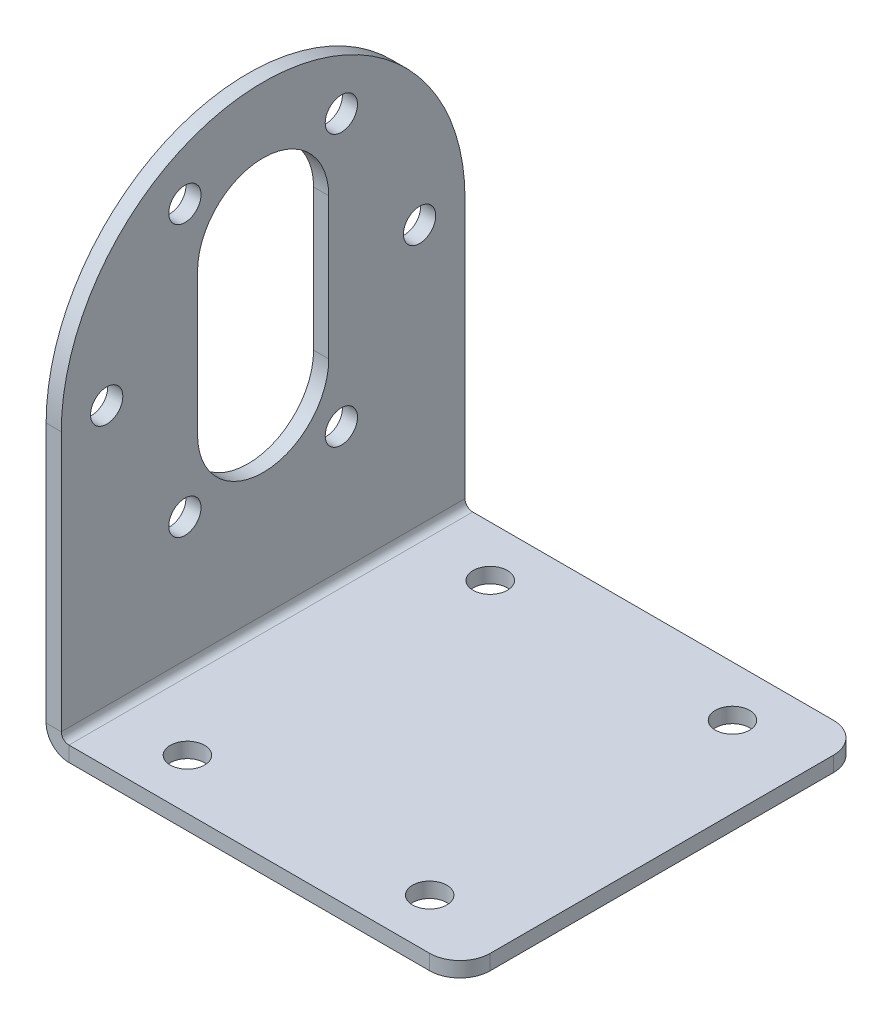
ISO-10303-21;
HEADER;
FILE_DESCRIPTION(('STEP AP214'),'2;1');
FILE_NAME('part.step','',(''),(''),'','','');
FILE_SCHEMA(('AUTOMOTIVE_DESIGN { 1 0 10303 214 1 1 1 1 }'));
ENDSEC;
DATA;
#1=APPLICATION_CONTEXT('core data for automotive mechanical design processes');
#2=APPLICATION_PROTOCOL_DEFINITION('international standard','automotive_design',2000,#1);
#3=PRODUCT_CONTEXT('',#1,'mechanical');
#4=PRODUCT('Part','Part','',(#3));
#5=PRODUCT_RELATED_PRODUCT_CATEGORY('part','',(#4));
#6=PRODUCT_DEFINITION_FORMATION('','',#4);
#7=PRODUCT_DEFINITION_CONTEXT('part definition',#1,'design');
#8=PRODUCT_DEFINITION('design','',#6,#7);
#9=PRODUCT_DEFINITION_SHAPE('','',#8);
#10=(LENGTH_UNIT() NAMED_UNIT(*) SI_UNIT(.MILLI.,.METRE.));
#11=(NAMED_UNIT(*) PLANE_ANGLE_UNIT() SI_UNIT($,.RADIAN.));
#12=(NAMED_UNIT(*) SI_UNIT($,.STERADIAN.) SOLID_ANGLE_UNIT());
#13=UNCERTAINTY_MEASURE_WITH_UNIT(LENGTH_MEASURE(1.E-05),#10,'distance_accuracy_value','');
#14=(GEOMETRIC_REPRESENTATION_CONTEXT(3) GLOBAL_UNCERTAINTY_ASSIGNED_CONTEXT((#13)) GLOBAL_UNIT_ASSIGNED_CONTEXT((#10,
#11,#12)) REPRESENTATION_CONTEXT('',''));
#15=CARTESIAN_POINT('',(0.,0.,0.));
#16=DIRECTION('',(0.,0.,1.));
#17=DIRECTION('',(1.,0.,0.));
#18=AXIS2_PLACEMENT_3D('',#15,#16,#17);
#19=CARTESIAN_POINT('',(0.,0.,0.));
#20=DIRECTION('',(1.,0.,0.));
#21=DIRECTION('',(0.,0.,-1.));
#22=AXIS2_PLACEMENT_3D('',#19,#20,#21);
#23=PLANE('',#22);
#24=DIRECTION('',(0.,-1.,0.));
#25=VECTOR('',#24,1.);
#26=CARTESIAN_POINT('',(0.,7.,-6.5));
#27=LINE('',#26,#25);
#28=CARTESIAN_POINT('',(0.,7.,-6.5));
#29=VERTEX_POINT('',#28);
#30=CARTESIAN_POINT('',(0.,-7.,-6.5));
#31=VERTEX_POINT('',#30);
#32=EDGE_CURVE('E157',#29,#31,#27,.T.);
#33=ORIENTED_EDGE('',*,*,#32,.F.);
#34=CARTESIAN_POINT('',(0.,7.,0.));
#35=DIRECTION('',(-1.,0.,0.));
#36=DIRECTION('',(0.,0.,1.));
#37=AXIS2_PLACEMENT_3D('',#34,#35,#36);
#38=CIRCLE('',#37,6.5);
#39=CARTESIAN_POINT('',(0.,7.,6.5));
#40=VERTEX_POINT('',#39);
#41=EDGE_CURVE('E162',#40,#29,#38,.T.);
#42=ORIENTED_EDGE('',*,*,#41,.F.);
#43=DIRECTION('',(0.,1.,0.));
#44=VECTOR('',#43,1.);
#45=CARTESIAN_POINT('',(0.,7.,6.5));
#46=LINE('',#45,#44);
#47=CARTESIAN_POINT('',(0.,-7.,6.5));
#48=VERTEX_POINT('',#47);
#49=EDGE_CURVE('E166',#48,#40,#46,.T.);
#50=ORIENTED_EDGE('',*,*,#49,.F.);
#51=CARTESIAN_POINT('',(0.,-7.,0.));
#52=DIRECTION('',(-1.,0.,0.));
#53=DIRECTION('',(0.,0.,1.));
#54=AXIS2_PLACEMENT_3D('',#51,#52,#53);
#55=CIRCLE('',#54,6.5);
#56=EDGE_CURVE('E146',#31,#48,#55,.T.);
#57=ORIENTED_EDGE('',*,*,#56,.F.);
#58=EDGE_LOOP('',(#33,#42,#50,#57));
#59=FACE_BOUND('',#58,.T.);
#60=CARTESIAN_POINT('',(0.,-13.4233937586589,7.74999999999988));
#61=DIRECTION('',(-1.,0.,0.));
#62=DIRECTION('',(0.,0.,1.));
#63=AXIS2_PLACEMENT_3D('',#60,#61,#62);
#64=CIRCLE('',#63,1.6);
#65=CARTESIAN_POINT('',(0.,-13.4233937586589,9.34999999999988));
#66=VERTEX_POINT('',#65);
#67=EDGE_CURVE('E181',#66,#66,#64,.T.);
#68=ORIENTED_EDGE('',*,*,#67,.F.);
#69=EDGE_LOOP('',(#68));
#70=FACE_BOUND('',#69,.T.);
#71=CARTESIAN_POINT('',(0.,13.4233937586588,7.75000000000006));
#72=DIRECTION('',(-1.,0.,0.));
#73=DIRECTION('',(0.,0.,1.));
#74=AXIS2_PLACEMENT_3D('',#71,#72,#73);
#75=CIRCLE('',#74,1.6);
#76=CARTESIAN_POINT('',(0.,13.4233937586588,9.35000000000006));
#77=VERTEX_POINT('',#76);
#78=EDGE_CURVE('E193',#77,#77,#75,.T.);
#79=ORIENTED_EDGE('',*,*,#78,.F.);
#80=EDGE_LOOP('',(#79));
#81=FACE_BOUND('',#80,.T.);
#82=CARTESIAN_POINT('',(0.,13.4233937586588,-7.74999999999997));
#83=DIRECTION('',(-1.,0.,0.));
#84=DIRECTION('',(0.,0.,1.));
#85=AXIS2_PLACEMENT_3D('',#82,#83,#84);
#86=CIRCLE('',#85,1.6);
#87=CARTESIAN_POINT('',(0.,13.4233937586588,-6.14999999999997));
#88=VERTEX_POINT('',#87);
#89=EDGE_CURVE('E199',#88,#88,#86,.T.);
#90=ORIENTED_EDGE('',*,*,#89,.F.);
#91=EDGE_LOOP('',(#90));
#92=FACE_BOUND('',#91,.T.);
#93=CARTESIAN_POINT('',(0.,0.,-15.5));
#94=DIRECTION('',(-1.,0.,0.));
#95=DIRECTION('',(0.,0.,1.));
#96=AXIS2_PLACEMENT_3D('',#93,#94,#95);
#97=CIRCLE('',#96,1.6);
#98=CARTESIAN_POINT('',(0.,0.,-13.9));
#99=VERTEX_POINT('',#98);
#100=EDGE_CURVE('E203',#99,#99,#97,.T.);
#101=ORIENTED_EDGE('',*,*,#100,.F.);
#102=EDGE_LOOP('',(#101));
#103=FACE_BOUND('',#102,.T.);
#104=DIRECTION('',(0.,1.,0.));
#105=VECTOR('',#104,1.);
#106=CARTESIAN_POINT('',(0.,0.,-20.));
#107=LINE('',#106,#105);
#108=CARTESIAN_POINT('',(0.,-25.738,-20.));
#109=VERTEX_POINT('',#108);
#110=CARTESIAN_POINT('',(0.,0.,-20.));
#111=VERTEX_POINT('',#110);
#112=EDGE_CURVE('E224',#109,#111,#107,.T.);
#113=ORIENTED_EDGE('',*,*,#112,.F.);
#114=DIRECTION('',(0.,0.,-1.));
#115=VECTOR('',#114,1.);
#116=CARTESIAN_POINT('',(0.,-25.738,0.));
#117=LINE('',#116,#115);
#118=CARTESIAN_POINT('',(0.,-25.738,20.));
#119=VERTEX_POINT('',#118);
#120=EDGE_CURVE('E230',#109,#119,#117,.F.);
#121=ORIENTED_EDGE('',*,*,#120,.T.);
#122=DIRECTION('',(0.,-1.,0.));
#123=VECTOR('',#122,1.);
#124=CARTESIAN_POINT('',(0.,0.,20.));
#125=LINE('',#124,#123);
#126=CARTESIAN_POINT('',(0.,0.,20.));
#127=VERTEX_POINT('',#126);
#128=EDGE_CURVE('E218',#127,#119,#125,.T.);
#129=ORIENTED_EDGE('',*,*,#128,.F.);
#130=CARTESIAN_POINT('',(0.,0.,0.));
#131=DIRECTION('',(1.,0.,0.));
#132=DIRECTION('',(0.,0.,-1.));
#133=AXIS2_PLACEMENT_3D('',#130,#131,#132);
#134=CIRCLE('',#133,20.);
#135=EDGE_CURVE('E221',#111,#127,#134,.T.);
#136=ORIENTED_EDGE('',*,*,#135,.F.);
#137=EDGE_LOOP('',(#113,#121,#129,#136));
#138=FACE_BOUND('',#137,.T.);
#139=CARTESIAN_POINT('',(0.,0.,15.5));
#140=DIRECTION('',(-1.,0.,0.));
#141=DIRECTION('',(0.,0.,1.));
#142=AXIS2_PLACEMENT_3D('',#139,#140,#141);
#143=CIRCLE('',#142,1.6);
#144=CARTESIAN_POINT('',(0.,0.,17.1));
#145=VERTEX_POINT('',#144);
#146=EDGE_CURVE('E187',#145,#145,#143,.T.);
#147=ORIENTED_EDGE('',*,*,#146,.F.);
#148=EDGE_LOOP('',(#147));
#149=FACE_BOUND('',#148,.T.);
#150=CARTESIAN_POINT('',(0.,-13.4233937586587,-7.75000000000016));
#151=DIRECTION('',(-1.,0.,0.));
#152=DIRECTION('',(0.,0.,1.));
#153=AXIS2_PLACEMENT_3D('',#150,#151,#152);
#154=CIRCLE('',#153,1.6);
#155=CARTESIAN_POINT('',(0.,-13.4233937586587,-6.15000000000016));
#156=VERTEX_POINT('',#155);
#157=EDGE_CURVE('E173',#156,#156,#154,.T.);
#158=ORIENTED_EDGE('',*,*,#157,.F.);
#159=EDGE_LOOP('',(#158));
#160=FACE_BOUND('',#159,.T.);
#161=ADVANCED_FACE('F40',(#59,#70,#81,#92,#103,#138,#149,#160),#23,.F.);
#162=CARTESIAN_POINT('',(1.5,-28.,-20.));
#163=DIRECTION('',(0.,0.,-1.));
#164=DIRECTION('',(-1.,0.,0.));
#165=AXIS2_PLACEMENT_3D('',#162,#163,#164);
#166=PLANE('',#165);
#167=DIRECTION('',(1.,0.,0.));
#168=VECTOR('',#167,1.);
#169=CARTESIAN_POINT('',(1.5,-26.5,-20.));
#170=LINE('',#169,#168);
#171=CARTESIAN_POINT('',(38.,-26.5,-20.));
#172=VERTEX_POINT('',#171);
#173=CARTESIAN_POINT('',(2.262,-26.5,-20.));
#174=VERTEX_POINT('',#173);
#175=EDGE_CURVE('E258',#172,#174,#170,.F.);
#176=ORIENTED_EDGE('',*,*,#175,.F.);
#177=DIRECTION('',(0.,1.,0.));
#178=VECTOR('',#177,1.);
#179=CARTESIAN_POINT('',(38.,-28.,-20.));
#180=LINE('',#179,#178);
#181=CARTESIAN_POINT('',(38.,-28.,-20.));
#182=VERTEX_POINT('',#181);
#183=EDGE_CURVE('E287',#172,#182,#180,.F.);
#184=ORIENTED_EDGE('',*,*,#183,.T.);
#185=DIRECTION('',(-1.,0.,0.));
#186=VECTOR('',#185,1.);
#187=CARTESIAN_POINT('',(1.5,-28.,-20.));
#188=LINE('',#187,#186);
#189=CARTESIAN_POINT('',(2.262,-28.,-20.));
#190=VERTEX_POINT('',#189);
#191=EDGE_CURVE('E210',#182,#190,#188,.T.);
#192=ORIENTED_EDGE('',*,*,#191,.T.);
#193=DIRECTION('',(0.,-1.,0.));
#194=VECTOR('',#193,1.);
#195=CARTESIAN_POINT('',(2.262,-28.,-20.));
#196=LINE('',#195,#194);
#197=EDGE_CURVE('E274',#174,#190,#196,.T.);
#198=ORIENTED_EDGE('',*,*,#197,.F.);
#199=EDGE_LOOP('',(#176,#184,#192,#198));
#200=FACE_BOUND('',#199,.T.);
#201=ADVANCED_FACE('F308',(#200),#166,.T.);
#202=CARTESIAN_POINT('',(41.,-28.,20.));
#203=DIRECTION('',(-1.,0.,0.));
#204=DIRECTION('',(0.,0.,1.));
#205=AXIS2_PLACEMENT_3D('',#202,#203,#204);
#206=PLANE('',#205);
#207=DIRECTION('',(0.,0.,1.));
#208=VECTOR('',#207,1.);
#209=CARTESIAN_POINT('',(41.,-28.,20.));
#210=LINE('',#209,#208);
#211=CARTESIAN_POINT('',(41.,-28.,-17.));
#212=VERTEX_POINT('',#211);
#213=CARTESIAN_POINT('',(41.,-28.,17.));
#214=VERTEX_POINT('',#213);
#215=EDGE_CURVE('E212',#212,#214,#210,.T.);
#216=ORIENTED_EDGE('',*,*,#215,.F.);
#217=DIRECTION('',(0.,-1.,0.));
#218=VECTOR('',#217,1.);
#219=CARTESIAN_POINT('',(41.,-28.,-17.));
#220=LINE('',#219,#218);
#221=CARTESIAN_POINT('',(41.,-26.5,-17.));
#222=VERTEX_POINT('',#221);
#223=EDGE_CURVE('E297',#212,#222,#220,.F.);
#224=ORIENTED_EDGE('',*,*,#223,.T.);
#225=DIRECTION('',(0.,0.,1.));
#226=VECTOR('',#225,1.);
#227=CARTESIAN_POINT('',(41.,-26.5,20.));
#228=LINE('',#227,#226);
#229=CARTESIAN_POINT('',(41.,-26.5,17.));
#230=VERTEX_POINT('',#229);
#231=EDGE_CURVE('E260',#222,#230,#228,.T.);
#232=ORIENTED_EDGE('',*,*,#231,.T.);
#233=DIRECTION('',(0.,1.,0.));
#234=VECTOR('',#233,1.);
#235=CARTESIAN_POINT('',(41.,-28.,17.));
#236=LINE('',#235,#234);
#237=EDGE_CURVE('E294',#230,#214,#236,.F.);
#238=ORIENTED_EDGE('',*,*,#237,.T.);
#239=EDGE_LOOP('',(#216,#224,#232,#238));
#240=FACE_BOUND('',#239,.T.);
#241=ADVANCED_FACE('F315',(#240),#206,.F.);
#242=CARTESIAN_POINT('',(1.5,-28.,20.));
#243=DIRECTION('',(0.,0.,-1.));
#244=DIRECTION('',(-1.,0.,0.));
#245=AXIS2_PLACEMENT_3D('',#242,#243,#244);
#246=PLANE('',#245);
#247=DIRECTION('',(-1.,0.,0.));
#248=VECTOR('',#247,1.);
#249=CARTESIAN_POINT('',(1.5,-28.,20.));
#250=LINE('',#249,#248);
#251=CARTESIAN_POINT('',(38.,-28.,20.));
#252=VERTEX_POINT('',#251);
#253=CARTESIAN_POINT('',(2.262,-28.,20.));
#254=VERTEX_POINT('',#253);
#255=EDGE_CURVE('E216',#252,#254,#250,.T.);
#256=ORIENTED_EDGE('',*,*,#255,.F.);
#257=DIRECTION('',(0.,1.,0.));
#258=VECTOR('',#257,1.);
#259=CARTESIAN_POINT('',(38.,-28.,20.));
#260=LINE('',#259,#258);
#261=CARTESIAN_POINT('',(38.,-26.5,20.));
#262=VERTEX_POINT('',#261);
#263=EDGE_CURVE('E11',#252,#262,#260,.T.);
#264=ORIENTED_EDGE('',*,*,#263,.T.);
#265=DIRECTION('',(1.,0.,0.));
#266=VECTOR('',#265,1.);
#267=CARTESIAN_POINT('',(1.5,-26.5,20.));
#268=LINE('',#267,#266);
#269=CARTESIAN_POINT('',(2.262,-26.5,20.));
#270=VERTEX_POINT('',#269);
#271=EDGE_CURVE('E254',#262,#270,#268,.F.);
#272=ORIENTED_EDGE('',*,*,#271,.T.);
#273=DIRECTION('',(0.,-1.,0.));
#274=VECTOR('',#273,1.);
#275=CARTESIAN_POINT('',(2.262,-28.,20.));
#276=LINE('',#275,#274);
#277=EDGE_CURVE('E271',#270,#254,#276,.T.);
#278=ORIENTED_EDGE('',*,*,#277,.T.);
#279=EDGE_LOOP('',(#256,#264,#272,#278));
#280=FACE_BOUND('',#279,.T.);
#281=ADVANCED_FACE('F318',(#280),#246,.F.);
#282=CARTESIAN_POINT('',(2.262,-25.738,20.));
#283=DIRECTION('',(0.,0.,1.));
#284=DIRECTION('',(0.,-1.,0.));
#285=AXIS2_PLACEMENT_3D('',#282,#283,#284);
#286=PLANE('',#285);
#287=ORIENTED_EDGE('',*,*,#277,.F.);
#288=CARTESIAN_POINT('',(2.262,-25.738,20.));
#289=DIRECTION('',(0.,0.,-1.));
#290=DIRECTION('',(-1.,0.,0.));
#291=AXIS2_PLACEMENT_3D('',#288,#289,#290);
#292=CIRCLE('',#291,0.762);
#293=CARTESIAN_POINT('',(1.5,-25.738,20.));
#294=VERTEX_POINT('',#293);
#295=EDGE_CURVE('E255',#270,#294,#292,.T.);
#296=ORIENTED_EDGE('',*,*,#295,.T.);
#297=DIRECTION('',(-1.,0.,0.));
#298=VECTOR('',#297,1.);
#299=CARTESIAN_POINT('',(0.,-25.738,20.));
#300=LINE('',#299,#298);
#301=EDGE_CURVE('E269',#294,#119,#300,.T.);
#302=ORIENTED_EDGE('',*,*,#301,.T.);
#303=CARTESIAN_POINT('',(2.262,-25.738,20.));
#304=DIRECTION('',(0.,0.,-1.));
#305=DIRECTION('',(0.,1.,0.));
#306=AXIS2_PLACEMENT_3D('',#303,#304,#305);
#307=CIRCLE('',#306,2.262);
#308=EDGE_CURVE('E213',#254,#119,#307,.T.);
#309=ORIENTED_EDGE('',*,*,#308,.F.);
#310=EDGE_LOOP('',(#287,#296,#302,#309));
#311=FACE_BOUND('',#310,.T.);
#312=ADVANCED_FACE('F323',(#311),#286,.T.);
#313=CARTESIAN_POINT('',(0.,0.,20.));
#314=DIRECTION('',(0.,0.,1.));
#315=DIRECTION('',(0.,-1.,0.));
#316=AXIS2_PLACEMENT_3D('',#313,#314,#315);
#317=PLANE('',#316);
#318=ORIENTED_EDGE('',*,*,#301,.F.);
#319=DIRECTION('',(0.,1.,0.));
#320=VECTOR('',#319,1.);
#321=CARTESIAN_POINT('',(1.5,0.,20.));
#322=LINE('',#321,#320);
#323=CARTESIAN_POINT('',(1.5,0.,20.));
#324=VERTEX_POINT('',#323);
#325=EDGE_CURVE('E251',#324,#294,#322,.F.);
#326=ORIENTED_EDGE('',*,*,#325,.F.);
#327=DIRECTION('',(-1.,0.,0.));
#328=VECTOR('',#327,1.);
#329=CARTESIAN_POINT('',(0.,0.,20.));
#330=LINE('',#329,#328);
#331=EDGE_CURVE('E267',#324,#127,#330,.T.);
#332=ORIENTED_EDGE('',*,*,#331,.T.);
#333=ORIENTED_EDGE('',*,*,#128,.T.);
#334=EDGE_LOOP('',(#318,#326,#332,#333));
#335=FACE_BOUND('',#334,.T.);
#336=ADVANCED_FACE('F506',(#335),#317,.T.);
#337=CARTESIAN_POINT('',(0.,0.,0.));
#338=DIRECTION('',(1.,0.,0.));
#339=DIRECTION('',(0.,0.,-1.));
#340=AXIS2_PLACEMENT_3D('',#337,#338,#339);
#341=CYLINDRICAL_SURFACE('',#340,20.);
#342=ORIENTED_EDGE('',*,*,#331,.F.);
#343=CARTESIAN_POINT('',(1.5,0.,0.));
#344=DIRECTION('',(1.,0.,0.));
#345=DIRECTION('',(0.,0.,-1.));
#346=AXIS2_PLACEMENT_3D('',#343,#344,#345);
#347=CIRCLE('',#346,20.);
#348=CARTESIAN_POINT('',(1.5,0.,-20.));
#349=VERTEX_POINT('',#348);
#350=EDGE_CURVE('E248',#349,#324,#347,.T.);
#351=ORIENTED_EDGE('',*,*,#350,.F.);
#352=DIRECTION('',(-1.,0.,0.));
#353=VECTOR('',#352,1.);
#354=CARTESIAN_POINT('',(0.,0.,-20.));
#355=LINE('',#354,#353);
#356=EDGE_CURVE('E265',#349,#111,#355,.T.);
#357=ORIENTED_EDGE('',*,*,#356,.T.);
#358=ORIENTED_EDGE('',*,*,#135,.T.);
#359=EDGE_LOOP('',(#342,#351,#357,#358));
#360=FACE_BOUND('',#359,.T.);
#361=ADVANCED_FACE('F498',(#360),#341,.T.);
#362=CARTESIAN_POINT('',(0.,0.,-20.));
#363=DIRECTION('',(0.,0.,-1.));
#364=DIRECTION('',(0.,1.,0.));
#365=AXIS2_PLACEMENT_3D('',#362,#363,#364);
#366=PLANE('',#365);
#367=ORIENTED_EDGE('',*,*,#356,.F.);
#368=DIRECTION('',(0.,1.,0.));
#369=VECTOR('',#368,1.);
#370=CARTESIAN_POINT('',(1.5,0.,-20.));
#371=LINE('',#370,#369);
#372=CARTESIAN_POINT('',(1.5,-25.738,-20.));
#373=VERTEX_POINT('',#372);
#374=EDGE_CURVE('E245',#373,#349,#371,.T.);
#375=ORIENTED_EDGE('',*,*,#374,.F.);
#376=DIRECTION('',(-1.,0.,0.));
#377=VECTOR('',#376,1.);
#378=CARTESIAN_POINT('',(0.,-25.738,-20.));
#379=LINE('',#378,#377);
#380=EDGE_CURVE('E233',#373,#109,#379,.T.);
#381=ORIENTED_EDGE('',*,*,#380,.T.);
#382=ORIENTED_EDGE('',*,*,#112,.T.);
#383=EDGE_LOOP('',(#367,#375,#381,#382));
#384=FACE_BOUND('',#383,.T.);
#385=ADVANCED_FACE('F337',(#384),#366,.T.);
#386=CARTESIAN_POINT('',(2.262,-25.738,-20.));
#387=DIRECTION('',(0.,0.,1.));
#388=DIRECTION('',(0.,-1.,0.));
#389=AXIS2_PLACEMENT_3D('',#386,#387,#388);
#390=PLANE('',#389);
#391=CARTESIAN_POINT('',(2.262,-25.738,-20.));
#392=DIRECTION('',(0.,0.,-1.));
#393=DIRECTION('',(-1.,0.,0.));
#394=AXIS2_PLACEMENT_3D('',#391,#392,#393);
#395=CIRCLE('',#394,0.762);
#396=EDGE_CURVE('E209',#373,#174,#395,.F.);
#397=ORIENTED_EDGE('',*,*,#396,.T.);
#398=ORIENTED_EDGE('',*,*,#197,.T.);
#399=CARTESIAN_POINT('',(2.262,-25.738,-20.));
#400=DIRECTION('',(0.,0.,-1.));
#401=DIRECTION('',(0.,1.,0.));
#402=AXIS2_PLACEMENT_3D('',#399,#400,#401);
#403=CIRCLE('',#402,2.262);
#404=EDGE_CURVE('E234',#109,#190,#403,.F.);
#405=ORIENTED_EDGE('',*,*,#404,.F.);
#406=ORIENTED_EDGE('',*,*,#380,.F.);
#407=EDGE_LOOP('',(#397,#398,#405,#406));
#408=FACE_BOUND('',#407,.T.);
#409=ADVANCED_FACE('F330',(#408),#390,.F.);
#410=CARTESIAN_POINT('',(1.5,-28.,20.));
#411=DIRECTION('',(0.,1.,0.));
#412=DIRECTION('',(0.,0.,1.));
#413=AXIS2_PLACEMENT_3D('',#410,#411,#412);
#414=PLANE('',#413);
#415=CARTESIAN_POINT('',(9.00000000000001,-28.,-15.));
#416=DIRECTION('',(0.,1.,0.));
#417=DIRECTION('',(0.,0.,1.));
#418=AXIS2_PLACEMENT_3D('',#415,#416,#417);
#419=CIRCLE('',#418,1.7);
#420=CARTESIAN_POINT('',(9.00000000000001,-28.,-13.3));
#421=VERTEX_POINT('',#420);
#422=EDGE_CURVE('E449',#421,#421,#419,.T.);
#423=ORIENTED_EDGE('',*,*,#422,.T.);
#424=EDGE_LOOP('',(#423));
#425=FACE_BOUND('',#424,.T.);
#426=CARTESIAN_POINT('',(9.00000000000001,-28.,15.));
#427=DIRECTION('',(0.,1.,0.));
#428=DIRECTION('',(0.,0.,1.));
#429=AXIS2_PLACEMENT_3D('',#426,#427,#428);
#430=CIRCLE('',#429,1.7);
#431=CARTESIAN_POINT('',(9.00000000000001,-28.,16.7));
#432=VERTEX_POINT('',#431);
#433=EDGE_CURVE('E453',#432,#432,#430,.T.);
#434=ORIENTED_EDGE('',*,*,#433,.T.);
#435=EDGE_LOOP('',(#434));
#436=FACE_BOUND('',#435,.T.);
#437=CARTESIAN_POINT('',(33.,-28.,15.));
#438=DIRECTION('',(0.,1.,0.));
#439=DIRECTION('',(0.,0.,1.));
#440=AXIS2_PLACEMENT_3D('',#437,#438,#439);
#441=CIRCLE('',#440,1.7);
#442=CARTESIAN_POINT('',(33.,-28.,16.7));
#443=VERTEX_POINT('',#442);
#444=EDGE_CURVE('E465',#443,#443,#441,.T.);
#445=ORIENTED_EDGE('',*,*,#444,.T.);
#446=EDGE_LOOP('',(#445));
#447=FACE_BOUND('',#446,.T.);
#448=CARTESIAN_POINT('',(33.,-28.,-15.));
#449=DIRECTION('',(0.,1.,0.));
#450=DIRECTION('',(0.,0.,1.));
#451=AXIS2_PLACEMENT_3D('',#448,#449,#450);
#452=CIRCLE('',#451,1.7);
#453=CARTESIAN_POINT('',(33.,-28.,-13.3));
#454=VERTEX_POINT('',#453);
#455=EDGE_CURVE('E471',#454,#454,#452,.T.);
#456=ORIENTED_EDGE('',*,*,#455,.T.);
#457=EDGE_LOOP('',(#456));
#458=FACE_BOUND('',#457,.T.);
#459=ORIENTED_EDGE('',*,*,#191,.F.);
#460=CARTESIAN_POINT('',(38.,-28.,-17.));
#461=DIRECTION('',(0.,1.,0.));
#462=DIRECTION('',(0.,0.,1.));
#463=AXIS2_PLACEMENT_3D('',#460,#461,#462);
#464=CIRCLE('',#463,3.);
#465=EDGE_CURVE('E292',#182,#212,#464,.F.);
#466=ORIENTED_EDGE('',*,*,#465,.T.);
#467=ORIENTED_EDGE('',*,*,#215,.T.);
#468=CARTESIAN_POINT('',(38.,-28.,17.));
#469=DIRECTION('',(0.,1.,0.));
#470=DIRECTION('',(0.,0.,1.));
#471=AXIS2_PLACEMENT_3D('',#468,#469,#470);
#472=CIRCLE('',#471,3.);
#473=EDGE_CURVE('E290',#214,#252,#472,.F.);
#474=ORIENTED_EDGE('',*,*,#473,.T.);
#475=ORIENTED_EDGE('',*,*,#255,.T.);
#476=DIRECTION('',(0.,0.,-1.));
#477=VECTOR('',#476,1.);
#478=CARTESIAN_POINT('',(2.262,-28.,20.));
#479=LINE('',#478,#477);
#480=EDGE_CURVE('E227',#254,#190,#479,.T.);
#481=ORIENTED_EDGE('',*,*,#480,.T.);
#482=EDGE_LOOP('',(#459,#466,#467,#474,#475,#481));
#483=FACE_BOUND('',#482,.T.);
#484=ADVANCED_FACE('F313',(#425,#436,#447,#458,#483),#414,.F.);
#485=CARTESIAN_POINT('',(2.262,-25.738,20.));
#486=DIRECTION('',(0.,0.,-1.));
#487=DIRECTION('',(-1.,0.,0.));
#488=AXIS2_PLACEMENT_3D('',#485,#486,#487);
#489=CYLINDRICAL_SURFACE('',#488,2.262);
#490=ORIENTED_EDGE('',*,*,#308,.T.);
#491=ORIENTED_EDGE('',*,*,#120,.F.);
#492=ORIENTED_EDGE('',*,*,#404,.T.);
#493=ORIENTED_EDGE('',*,*,#480,.F.);
#494=EDGE_LOOP('',(#490,#491,#492,#493));
#495=FACE_BOUND('',#494,.T.);
#496=ADVANCED_FACE('F326',(#495),#489,.T.);
#497=CARTESIAN_POINT('',(1.5,0.,0.));
#498=DIRECTION('',(1.,0.,0.));
#499=DIRECTION('',(0.,0.,-1.));
#500=AXIS2_PLACEMENT_3D('',#497,#498,#499);
#501=PLANE('',#500);
#502=CARTESIAN_POINT('',(1.5,7.,0.));
#503=DIRECTION('',(1.,0.,0.));
#504=DIRECTION('',(0.,0.,-1.));
#505=AXIS2_PLACEMENT_3D('',#502,#503,#504);
#506=CIRCLE('',#505,6.5);
#507=CARTESIAN_POINT('',(1.50000000000002,7.,-6.5));
#508=VERTEX_POINT('',#507);
#509=CARTESIAN_POINT('',(1.50000000000002,7.,6.5));
#510=VERTEX_POINT('',#509);
#511=EDGE_CURVE('E285',#508,#510,#506,.T.);
#512=ORIENTED_EDGE('',*,*,#511,.F.);
#513=DIRECTION('',(0.,1.,0.));
#514=VECTOR('',#513,1.);
#515=CARTESIAN_POINT('',(1.5,0.,-6.5));
#516=LINE('',#515,#514);
#517=CARTESIAN_POINT('',(1.5,-7.,-6.5));
#518=VERTEX_POINT('',#517);
#519=EDGE_CURVE('E277',#518,#508,#516,.T.);
#520=ORIENTED_EDGE('',*,*,#519,.F.);
#521=CARTESIAN_POINT('',(1.5,-7.,0.));
#522=DIRECTION('',(1.,0.,0.));
#523=DIRECTION('',(0.,0.,-1.));
#524=AXIS2_PLACEMENT_3D('',#521,#522,#523);
#525=CIRCLE('',#524,6.5);
#526=CARTESIAN_POINT('',(1.50000000000002,-7.,6.5));
#527=VERTEX_POINT('',#526);
#528=EDGE_CURVE('E149',#527,#518,#525,.T.);
#529=ORIENTED_EDGE('',*,*,#528,.F.);
#530=DIRECTION('',(0.,-1.,0.));
#531=VECTOR('',#530,1.);
#532=CARTESIAN_POINT('',(1.5,0.,6.5));
#533=LINE('',#532,#531);
#534=EDGE_CURVE('E283',#510,#527,#533,.T.);
#535=ORIENTED_EDGE('',*,*,#534,.F.);
#536=EDGE_LOOP('',(#512,#520,#529,#535));
#537=FACE_BOUND('',#536,.T.);
#538=CARTESIAN_POINT('',(1.5,-13.4233937586587,-7.75000000000016));
#539=DIRECTION('',(1.,0.,0.));
#540=DIRECTION('',(0.,0.,-1.));
#541=AXIS2_PLACEMENT_3D('',#538,#539,#540);
#542=CIRCLE('',#541,1.59999999999999);
#543=CARTESIAN_POINT('',(1.5,-13.4233937586587,-9.35000000000015));
#544=VERTEX_POINT('',#543);
#545=EDGE_CURVE('E178',#544,#544,#542,.T.);
#546=ORIENTED_EDGE('',*,*,#545,.F.);
#547=EDGE_LOOP('',(#546));
#548=FACE_BOUND('',#547,.T.);
#549=CARTESIAN_POINT('',(1.5,-13.4233937586589,7.74999999999988));
#550=DIRECTION('',(1.,0.,0.));
#551=DIRECTION('',(0.,0.,-1.));
#552=AXIS2_PLACEMENT_3D('',#549,#550,#551);
#553=CIRCLE('',#552,1.59999999999999);
#554=CARTESIAN_POINT('',(1.5,-13.4233937586589,6.14999999999988));
#555=VERTEX_POINT('',#554);
#556=EDGE_CURVE('E184',#555,#555,#553,.T.);
#557=ORIENTED_EDGE('',*,*,#556,.F.);
#558=EDGE_LOOP('',(#557));
#559=FACE_BOUND('',#558,.T.);
#560=CARTESIAN_POINT('',(1.5,0.,15.5));
#561=DIRECTION('',(1.,0.,0.));
#562=DIRECTION('',(0.,0.,-1.));
#563=AXIS2_PLACEMENT_3D('',#560,#561,#562);
#564=CIRCLE('',#563,1.59999999999999);
#565=CARTESIAN_POINT('',(1.5,0.,13.9));
#566=VERTEX_POINT('',#565);
#567=EDGE_CURVE('E190',#566,#566,#564,.T.);
#568=ORIENTED_EDGE('',*,*,#567,.F.);
#569=EDGE_LOOP('',(#568));
#570=FACE_BOUND('',#569,.T.);
#571=CARTESIAN_POINT('',(1.5,13.4233937586588,7.75000000000006));
#572=DIRECTION('',(1.,0.,0.));
#573=DIRECTION('',(0.,0.,-1.));
#574=AXIS2_PLACEMENT_3D('',#571,#572,#573);
#575=CIRCLE('',#574,1.59999999999999);
#576=CARTESIAN_POINT('',(1.5,13.4233937586588,6.15000000000007));
#577=VERTEX_POINT('',#576);
#578=EDGE_CURVE('E196',#577,#577,#575,.T.);
#579=ORIENTED_EDGE('',*,*,#578,.F.);
#580=EDGE_LOOP('',(#579));
#581=FACE_BOUND('',#580,.T.);
#582=CARTESIAN_POINT('',(1.5,13.4233937586588,-7.74999999999997));
#583=DIRECTION('',(1.,0.,0.));
#584=DIRECTION('',(0.,0.,-1.));
#585=AXIS2_PLACEMENT_3D('',#582,#583,#584);
#586=CIRCLE('',#585,1.59999999999999);
#587=CARTESIAN_POINT('',(1.5,13.4233937586588,-9.34999999999996));
#588=VERTEX_POINT('',#587);
#589=EDGE_CURVE('E202',#588,#588,#586,.T.);
#590=ORIENTED_EDGE('',*,*,#589,.F.);
#591=EDGE_LOOP('',(#590));
#592=FACE_BOUND('',#591,.T.);
#593=CARTESIAN_POINT('',(1.5,0.,-15.5));
#594=DIRECTION('',(1.,0.,0.));
#595=DIRECTION('',(0.,0.,-1.));
#596=AXIS2_PLACEMENT_3D('',#593,#594,#595);
#597=CIRCLE('',#596,1.59999999999999);
#598=CARTESIAN_POINT('',(1.5,0.,-17.1));
#599=VERTEX_POINT('',#598);
#600=EDGE_CURVE('E206',#599,#599,#597,.T.);
#601=ORIENTED_EDGE('',*,*,#600,.F.);
#602=EDGE_LOOP('',(#601));
#603=FACE_BOUND('',#602,.T.);
#604=ORIENTED_EDGE('',*,*,#374,.T.);
#605=ORIENTED_EDGE('',*,*,#350,.T.);
#606=ORIENTED_EDGE('',*,*,#325,.T.);
#607=DIRECTION('',(0.,0.,-1.));
#608=VECTOR('',#607,1.);
#609=CARTESIAN_POINT('',(1.5,-25.738,0.));
#610=LINE('',#609,#608);
#611=EDGE_CURVE('E237',#373,#294,#610,.F.);
#612=ORIENTED_EDGE('',*,*,#611,.F.);
#613=EDGE_LOOP('',(#604,#605,#606,#612));
#614=FACE_BOUND('',#613,.T.);
#615=ADVANCED_FACE('F341',(#537,#548,#559,#570,#581,#592,#603,#614),#501,.T.);
#616=CARTESIAN_POINT('',(1.5,-26.5,20.));
#617=DIRECTION('',(0.,1.,0.));
#618=DIRECTION('',(0.,0.,1.));
#619=AXIS2_PLACEMENT_3D('',#616,#617,#618);
#620=PLANE('',#619);
#621=CARTESIAN_POINT('',(9.00000000000001,-26.5,-15.));
#622=DIRECTION('',(0.,1.,0.));
#623=DIRECTION('',(0.,0.,1.));
#624=AXIS2_PLACEMENT_3D('',#621,#622,#623);
#625=CIRCLE('',#624,1.7);
#626=CARTESIAN_POINT('',(9.00000000000001,-26.5,-13.3));
#627=VERTEX_POINT('',#626);
#628=EDGE_CURVE('E452',#627,#627,#625,.T.);
#629=ORIENTED_EDGE('',*,*,#628,.F.);
#630=EDGE_LOOP('',(#629));
#631=FACE_BOUND('',#630,.T.);
#632=CARTESIAN_POINT('',(9.00000000000001,-26.5,15.));
#633=DIRECTION('',(0.,1.,0.));
#634=DIRECTION('',(0.,0.,1.));
#635=AXIS2_PLACEMENT_3D('',#632,#633,#634);
#636=CIRCLE('',#635,1.7);
#637=CARTESIAN_POINT('',(9.00000000000001,-26.5,16.7));
#638=VERTEX_POINT('',#637);
#639=EDGE_CURVE('E456',#638,#638,#636,.T.);
#640=ORIENTED_EDGE('',*,*,#639,.F.);
#641=EDGE_LOOP('',(#640));
#642=FACE_BOUND('',#641,.T.);
#643=CARTESIAN_POINT('',(33.,-26.5,15.));
#644=DIRECTION('',(0.,1.,0.));
#645=DIRECTION('',(0.,0.,1.));
#646=AXIS2_PLACEMENT_3D('',#643,#644,#645);
#647=CIRCLE('',#646,1.7);
#648=CARTESIAN_POINT('',(33.,-26.5,16.7));
#649=VERTEX_POINT('',#648);
#650=EDGE_CURVE('E462',#649,#649,#647,.T.);
#651=ORIENTED_EDGE('',*,*,#650,.F.);
#652=EDGE_LOOP('',(#651));
#653=FACE_BOUND('',#652,.T.);
#654=CARTESIAN_POINT('',(33.,-26.5,-15.));
#655=DIRECTION('',(0.,1.,0.));
#656=DIRECTION('',(0.,0.,1.));
#657=AXIS2_PLACEMENT_3D('',#654,#655,#656);
#658=CIRCLE('',#657,1.7);
#659=CARTESIAN_POINT('',(33.,-26.5,-13.3));
#660=VERTEX_POINT('',#659);
#661=EDGE_CURVE('E468',#660,#660,#658,.T.);
#662=ORIENTED_EDGE('',*,*,#661,.F.);
#663=EDGE_LOOP('',(#662));
#664=FACE_BOUND('',#663,.T.);
#665=ORIENTED_EDGE('',*,*,#231,.F.);
#666=CARTESIAN_POINT('',(38.,-26.5,-17.));
#667=DIRECTION('',(0.,1.,0.));
#668=DIRECTION('',(0.,0.,1.));
#669=AXIS2_PLACEMENT_3D('',#666,#667,#668);
#670=CIRCLE('',#669,3.);
#671=EDGE_CURVE('E48',#222,#172,#670,.T.);
#672=ORIENTED_EDGE('',*,*,#671,.T.);
#673=ORIENTED_EDGE('',*,*,#175,.T.);
#674=DIRECTION('',(0.,0.,1.));
#675=VECTOR('',#674,1.);
#676=CARTESIAN_POINT('',(2.262,-26.5,20.));
#677=LINE('',#676,#675);
#678=EDGE_CURVE('E242',#270,#174,#677,.F.);
#679=ORIENTED_EDGE('',*,*,#678,.F.);
#680=ORIENTED_EDGE('',*,*,#271,.F.);
#681=CARTESIAN_POINT('',(38.,-26.5,17.));
#682=DIRECTION('',(0.,1.,0.));
#683=DIRECTION('',(0.,0.,1.));
#684=AXIS2_PLACEMENT_3D('',#681,#682,#683);
#685=CIRCLE('',#684,3.);
#686=EDGE_CURVE('E60',#262,#230,#685,.T.);
#687=ORIENTED_EDGE('',*,*,#686,.T.);
#688=EDGE_LOOP('',(#665,#672,#673,#679,#680,#687));
#689=FACE_BOUND('',#688,.T.);
#690=ADVANCED_FACE('F301',(#631,#642,#653,#664,#689),#620,.T.);
#691=CARTESIAN_POINT('',(2.262,-25.738,20.));
#692=DIRECTION('',(0.,0.,-1.));
#693=DIRECTION('',(-1.,0.,0.));
#694=AXIS2_PLACEMENT_3D('',#691,#692,#693);
#695=CYLINDRICAL_SURFACE('',#694,0.762);
#696=ORIENTED_EDGE('',*,*,#295,.F.);
#697=ORIENTED_EDGE('',*,*,#678,.T.);
#698=ORIENTED_EDGE('',*,*,#396,.F.);
#699=ORIENTED_EDGE('',*,*,#611,.T.);
#700=EDGE_LOOP('',(#696,#697,#698,#699));
#701=FACE_BOUND('',#700,.T.);
#702=ADVANCED_FACE('F346',(#701),#695,.F.);
#703=CARTESIAN_POINT('',(0.,0.,-15.5));
#704=DIRECTION('',(-1.,0.,0.));
#705=DIRECTION('',(0.,0.,1.));
#706=AXIS2_PLACEMENT_3D('',#703,#704,#705);
#707=CYLINDRICAL_SURFACE('',#706,1.59999999999999);
#708=ORIENTED_EDGE('',*,*,#600,.T.);
#709=EDGE_LOOP('',(#708));
#710=FACE_BOUND('',#709,.T.);
#711=ORIENTED_EDGE('',*,*,#100,.T.);
#712=EDGE_LOOP('',(#711));
#713=FACE_BOUND('',#712,.T.);
#714=ADVANCED_FACE('F348',(#710,#713),#707,.F.);
#715=CARTESIAN_POINT('',(0.,13.4233937586588,-7.74999999999997));
#716=DIRECTION('',(-1.,0.,0.));
#717=DIRECTION('',(0.,0.,1.));
#718=AXIS2_PLACEMENT_3D('',#715,#716,#717);
#719=CYLINDRICAL_SURFACE('',#718,1.59999999999999);
#720=ORIENTED_EDGE('',*,*,#589,.T.);
#721=EDGE_LOOP('',(#720));
#722=FACE_BOUND('',#721,.T.);
#723=ORIENTED_EDGE('',*,*,#89,.T.);
#724=EDGE_LOOP('',(#723));
#725=FACE_BOUND('',#724,.T.);
#726=ADVANCED_FACE('F354',(#722,#725),#719,.F.);
#727=CARTESIAN_POINT('',(0.,13.4233937586588,7.75000000000006));
#728=DIRECTION('',(-1.,0.,0.));
#729=DIRECTION('',(0.,0.,1.));
#730=AXIS2_PLACEMENT_3D('',#727,#728,#729);
#731=CYLINDRICAL_SURFACE('',#730,1.59999999999999);
#732=ORIENTED_EDGE('',*,*,#578,.T.);
#733=EDGE_LOOP('',(#732));
#734=FACE_BOUND('',#733,.T.);
#735=ORIENTED_EDGE('',*,*,#78,.T.);
#736=EDGE_LOOP('',(#735));
#737=FACE_BOUND('',#736,.T.);
#738=ADVANCED_FACE('F394',(#734,#737),#731,.F.);
#739=CARTESIAN_POINT('',(0.,0.,15.5));
#740=DIRECTION('',(-1.,0.,0.));
#741=DIRECTION('',(0.,0.,1.));
#742=AXIS2_PLACEMENT_3D('',#739,#740,#741);
#743=CYLINDRICAL_SURFACE('',#742,1.59999999999999);
#744=ORIENTED_EDGE('',*,*,#567,.T.);
#745=EDGE_LOOP('',(#744));
#746=FACE_BOUND('',#745,.T.);
#747=ORIENTED_EDGE('',*,*,#146,.T.);
#748=EDGE_LOOP('',(#747));
#749=FACE_BOUND('',#748,.T.);
#750=ADVANCED_FACE('F401',(#746,#749),#743,.F.);
#751=CARTESIAN_POINT('',(0.,-13.4233937586589,7.74999999999988));
#752=DIRECTION('',(-1.,0.,0.));
#753=DIRECTION('',(0.,0.,1.));
#754=AXIS2_PLACEMENT_3D('',#751,#752,#753);
#755=CYLINDRICAL_SURFACE('',#754,1.59999999999999);
#756=ORIENTED_EDGE('',*,*,#556,.T.);
#757=EDGE_LOOP('',(#756));
#758=FACE_BOUND('',#757,.T.);
#759=ORIENTED_EDGE('',*,*,#67,.T.);
#760=EDGE_LOOP('',(#759));
#761=FACE_BOUND('',#760,.T.);
#762=ADVANCED_FACE('F407',(#758,#761),#755,.F.);
#763=CARTESIAN_POINT('',(0.,-13.4233937586587,-7.75000000000016));
#764=DIRECTION('',(-1.,0.,0.));
#765=DIRECTION('',(0.,0.,1.));
#766=AXIS2_PLACEMENT_3D('',#763,#764,#765);
#767=CYLINDRICAL_SURFACE('',#766,1.59999999999999);
#768=ORIENTED_EDGE('',*,*,#545,.T.);
#769=EDGE_LOOP('',(#768));
#770=FACE_BOUND('',#769,.T.);
#771=ORIENTED_EDGE('',*,*,#157,.T.);
#772=EDGE_LOOP('',(#771));
#773=FACE_BOUND('',#772,.T.);
#774=ADVANCED_FACE('F411',(#770,#773),#767,.F.);
#775=CARTESIAN_POINT('',(41.,7.,0.));
#776=DIRECTION('',(-1.,0.,0.));
#777=DIRECTION('',(0.,0.,1.));
#778=AXIS2_PLACEMENT_3D('',#775,#776,#777);
#779=CYLINDRICAL_SURFACE('',#778,6.5);
#780=ORIENTED_EDGE('',*,*,#511,.T.);
#781=DIRECTION('',(-1.,0.,0.));
#782=VECTOR('',#781,1.);
#783=CARTESIAN_POINT('',(41.,7.,6.5));
#784=LINE('',#783,#782);
#785=EDGE_CURVE('E171',#510,#40,#784,.T.);
#786=ORIENTED_EDGE('',*,*,#785,.T.);
#787=ORIENTED_EDGE('',*,*,#41,.T.);
#788=DIRECTION('',(-1.,0.,0.));
#789=VECTOR('',#788,1.);
#790=CARTESIAN_POINT('',(41.,7.,-6.5));
#791=LINE('',#790,#789);
#792=EDGE_CURVE('E153',#508,#29,#791,.T.);
#793=ORIENTED_EDGE('',*,*,#792,.F.);
#794=EDGE_LOOP('',(#780,#786,#787,#793));
#795=FACE_BOUND('',#794,.T.);
#796=ADVANCED_FACE('F415',(#795),#779,.F.);
#797=CARTESIAN_POINT('',(41.,7.,6.5));
#798=DIRECTION('',(0.,0.,1.));
#799=DIRECTION('',(0.,-1.,0.));
#800=AXIS2_PLACEMENT_3D('',#797,#798,#799);
#801=PLANE('',#800);
#802=ORIENTED_EDGE('',*,*,#534,.T.);
#803=DIRECTION('',(-1.,0.,0.));
#804=VECTOR('',#803,1.);
#805=CARTESIAN_POINT('',(41.,-7.,6.5));
#806=LINE('',#805,#804);
#807=EDGE_CURVE('E152',#527,#48,#806,.T.);
#808=ORIENTED_EDGE('',*,*,#807,.T.);
#809=ORIENTED_EDGE('',*,*,#49,.T.);
#810=ORIENTED_EDGE('',*,*,#785,.F.);
#811=EDGE_LOOP('',(#802,#808,#809,#810));
#812=FACE_BOUND('',#811,.T.);
#813=ADVANCED_FACE('F419',(#812),#801,.F.);
#814=CARTESIAN_POINT('',(41.,-7.,0.));
#815=DIRECTION('',(-1.,0.,0.));
#816=DIRECTION('',(0.,0.,1.));
#817=AXIS2_PLACEMENT_3D('',#814,#815,#816);
#818=CYLINDRICAL_SURFACE('',#817,6.5);
#819=ORIENTED_EDGE('',*,*,#528,.T.);
#820=DIRECTION('',(-1.,0.,0.));
#821=VECTOR('',#820,1.);
#822=CARTESIAN_POINT('',(41.,-7.,-6.5));
#823=LINE('',#822,#821);
#824=EDGE_CURVE('E141',#518,#31,#823,.T.);
#825=ORIENTED_EDGE('',*,*,#824,.T.);
#826=ORIENTED_EDGE('',*,*,#56,.T.);
#827=ORIENTED_EDGE('',*,*,#807,.F.);
#828=EDGE_LOOP('',(#819,#825,#826,#827));
#829=FACE_BOUND('',#828,.T.);
#830=ADVANCED_FACE('F143',(#829),#818,.F.);
#831=CARTESIAN_POINT('',(41.,7.,-6.5));
#832=DIRECTION('',(0.,0.,-1.));
#833=DIRECTION('',(0.,1.,0.));
#834=AXIS2_PLACEMENT_3D('',#831,#832,#833);
#835=PLANE('',#834);
#836=ORIENTED_EDGE('',*,*,#519,.T.);
#837=ORIENTED_EDGE('',*,*,#792,.T.);
#838=ORIENTED_EDGE('',*,*,#32,.T.);
#839=ORIENTED_EDGE('',*,*,#824,.F.);
#840=EDGE_LOOP('',(#836,#837,#838,#839));
#841=FACE_BOUND('',#840,.T.);
#842=ADVANCED_FACE('F158',(#841),#835,.F.);
#843=CARTESIAN_POINT('',(33.,-26.5,-15.));
#844=DIRECTION('',(0.,1.,0.));
#845=DIRECTION('',(0.,0.,1.));
#846=AXIS2_PLACEMENT_3D('',#843,#844,#845);
#847=CYLINDRICAL_SURFACE('',#846,1.7);
#848=ORIENTED_EDGE('',*,*,#455,.F.);
#849=EDGE_LOOP('',(#848));
#850=FACE_BOUND('',#849,.T.);
#851=ORIENTED_EDGE('',*,*,#661,.T.);
#852=EDGE_LOOP('',(#851));
#853=FACE_BOUND('',#852,.T.);
#854=ADVANCED_FACE('F423',(#850,#853),#847,.F.);
#855=CARTESIAN_POINT('',(33.,-26.5,15.));
#856=DIRECTION('',(0.,1.,0.));
#857=DIRECTION('',(0.,0.,1.));
#858=AXIS2_PLACEMENT_3D('',#855,#856,#857);
#859=CYLINDRICAL_SURFACE('',#858,1.7);
#860=ORIENTED_EDGE('',*,*,#444,.F.);
#861=EDGE_LOOP('',(#860));
#862=FACE_BOUND('',#861,.T.);
#863=ORIENTED_EDGE('',*,*,#650,.T.);
#864=EDGE_LOOP('',(#863));
#865=FACE_BOUND('',#864,.T.);
#866=ADVANCED_FACE('F431',(#862,#865),#859,.F.);
#867=CARTESIAN_POINT('',(9.00000000000001,-26.5,15.));
#868=DIRECTION('',(0.,1.,0.));
#869=DIRECTION('',(0.,0.,1.));
#870=AXIS2_PLACEMENT_3D('',#867,#868,#869);
#871=CYLINDRICAL_SURFACE('',#870,1.7);
#872=ORIENTED_EDGE('',*,*,#433,.F.);
#873=EDGE_LOOP('',(#872));
#874=FACE_BOUND('',#873,.T.);
#875=ORIENTED_EDGE('',*,*,#639,.T.);
#876=EDGE_LOOP('',(#875));
#877=FACE_BOUND('',#876,.T.);
#878=ADVANCED_FACE('F435',(#874,#877),#871,.F.);
#879=CARTESIAN_POINT('',(9.00000000000001,-26.5,-15.));
#880=DIRECTION('',(0.,1.,0.));
#881=DIRECTION('',(0.,0.,1.));
#882=AXIS2_PLACEMENT_3D('',#879,#880,#881);
#883=CYLINDRICAL_SURFACE('',#882,1.7);
#884=ORIENTED_EDGE('',*,*,#422,.F.);
#885=EDGE_LOOP('',(#884));
#886=FACE_BOUND('',#885,.T.);
#887=ORIENTED_EDGE('',*,*,#628,.T.);
#888=EDGE_LOOP('',(#887));
#889=FACE_BOUND('',#888,.T.);
#890=ADVANCED_FACE('F439',(#886,#889),#883,.F.);
#891=CARTESIAN_POINT('',(38.,-28.,-17.));
#892=DIRECTION('',(0.,1.,0.));
#893=DIRECTION('',(0.,0.,1.));
#894=AXIS2_PLACEMENT_3D('',#891,#892,#893);
#895=CYLINDRICAL_SURFACE('',#894,3.);
#896=ORIENTED_EDGE('',*,*,#671,.F.);
#897=ORIENTED_EDGE('',*,*,#223,.F.);
#898=ORIENTED_EDGE('',*,*,#465,.F.);
#899=ORIENTED_EDGE('',*,*,#183,.F.);
#900=EDGE_LOOP('',(#896,#897,#898,#899));
#901=FACE_BOUND('',#900,.T.);
#902=ADVANCED_FACE('F310',(#901),#895,.T.);
#903=CARTESIAN_POINT('',(38.,-28.,17.));
#904=DIRECTION('',(0.,-1.,0.));
#905=DIRECTION('',(0.,0.,-1.));
#906=AXIS2_PLACEMENT_3D('',#903,#904,#905);
#907=CYLINDRICAL_SURFACE('',#906,3.);
#908=ORIENTED_EDGE('',*,*,#686,.F.);
#909=ORIENTED_EDGE('',*,*,#263,.F.);
#910=ORIENTED_EDGE('',*,*,#473,.F.);
#911=ORIENTED_EDGE('',*,*,#237,.F.);
#912=EDGE_LOOP('',(#908,#909,#910,#911));
#913=FACE_BOUND('',#912,.T.);
#914=ADVANCED_FACE('F42',(#913),#907,.T.);
#915=CLOSED_SHELL('',(#161,#201,#241,#281,#312,#336,#361,#385,#409,#484,#496,#615,#690,#702,
#714,#726,#738,#750,#762,#774,#796,#813,#830,#842,#854,#866,#878,#890,#902,#914));
#916=MANIFOLD_SOLID_BREP('B2',#915);
#917=ADVANCED_BREP_SHAPE_REPRESENTATION('',(#18,#916),#14);
#918=SHAPE_DEFINITION_REPRESENTATION(#9,#917);
ENDSEC;
END-ISO-10303-21;
